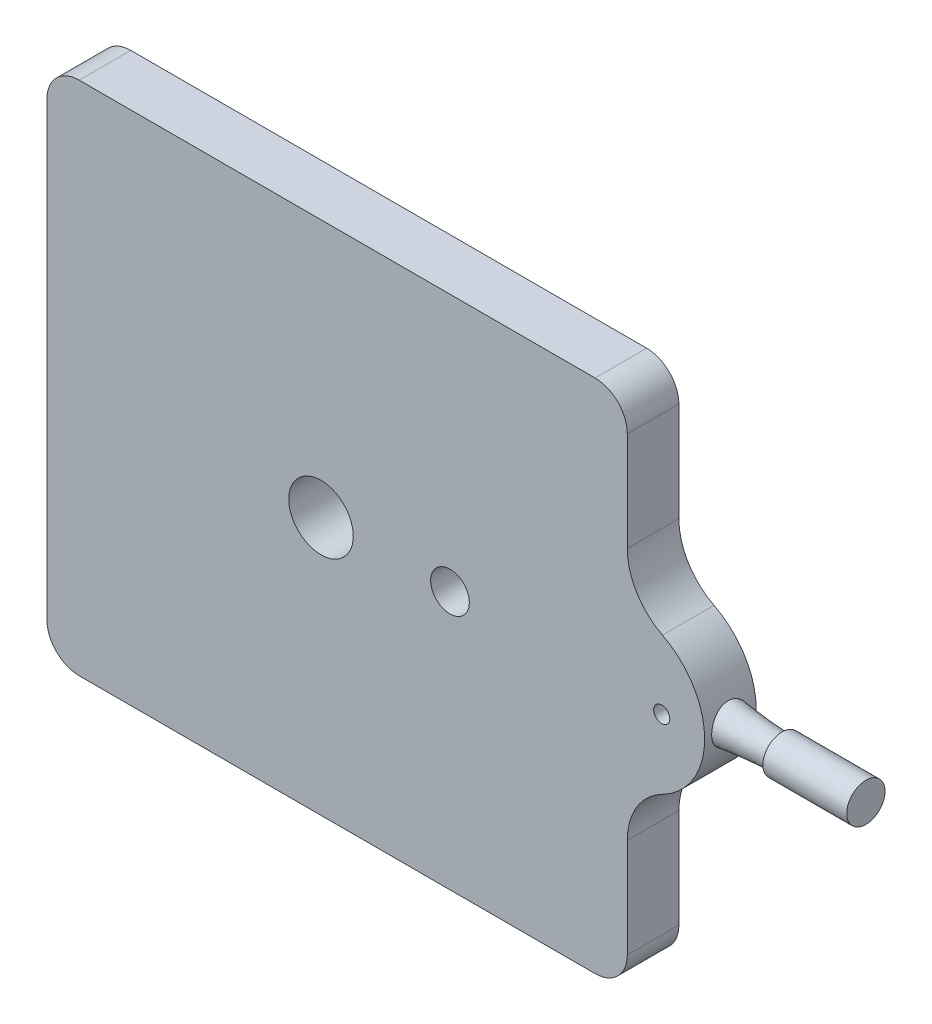
ISO-10303-21;
HEADER;
FILE_DESCRIPTION(('STEP AP214'),'2;1');
FILE_NAME('part.step','',(''),(''),'','','');
FILE_SCHEMA(('AUTOMOTIVE_DESIGN { 1 0 10303 214 1 1 1 1 }'));
ENDSEC;
DATA;
#1=APPLICATION_CONTEXT('core data for automotive mechanical design processes');
#2=APPLICATION_PROTOCOL_DEFINITION('international standard','automotive_design',2000,#1);
#3=PRODUCT_CONTEXT('',#1,'mechanical');
#4=PRODUCT('Part','Part','',(#3));
#5=PRODUCT_RELATED_PRODUCT_CATEGORY('part','',(#4));
#6=PRODUCT_DEFINITION_FORMATION('','',#4);
#7=PRODUCT_DEFINITION_CONTEXT('part definition',#1,'design');
#8=PRODUCT_DEFINITION('design','',#6,#7);
#9=PRODUCT_DEFINITION_SHAPE('','',#8);
#10=(LENGTH_UNIT() NAMED_UNIT(*) SI_UNIT(.MILLI.,.METRE.));
#11=(NAMED_UNIT(*) PLANE_ANGLE_UNIT() SI_UNIT($,.RADIAN.));
#12=(NAMED_UNIT(*) SI_UNIT($,.STERADIAN.) SOLID_ANGLE_UNIT());
#13=UNCERTAINTY_MEASURE_WITH_UNIT(LENGTH_MEASURE(1.E-05),#10,'distance_accuracy_value','');
#14=(GEOMETRIC_REPRESENTATION_CONTEXT(3) GLOBAL_UNCERTAINTY_ASSIGNED_CONTEXT((#13)) GLOBAL_UNIT_ASSIGNED_CONTEXT((#10,
#11,#12)) REPRESENTATION_CONTEXT('',''));
#15=CARTESIAN_POINT('',(0.,0.,0.));
#16=DIRECTION('',(0.,0.,1.));
#17=DIRECTION('',(1.,0.,0.));
#18=AXIS2_PLACEMENT_3D('',#15,#16,#17);
#19=CARTESIAN_POINT('',(98.,43.2575753217503,2.79937956443662));
#20=CARTESIAN_POINT('',(113.,40.4294832480824,1.70949875931951));
#21=CARTESIAN_POINT('',(98.,45.6588161928771,9.31453020793724));
#22=CARTESIAN_POINT('',(113.,45.0104857294434,2.56846525548432));
#23=CARTESIAN_POINT('',(98.,39.1436655493765,11.715771079064));
#24=CARTESIAN_POINT('',(113.,44.1515192332786,7.14946773684529));
#25=CARTESIAN_POINT('',(98.,36.7424246782497,5.20062043556338));
#26=CARTESIAN_POINT('',(113.,39.5705167519176,6.29050124068049));
#27=CARTESIAN_POINT('',(98.,34.3411838071229,-1.31453020793724));
#28=CARTESIAN_POINT('',(113.,34.9895142705566,5.43153474451568));
#29=CARTESIAN_POINT('',(98.,40.8563344506236,-3.715771079064));
#30=CARTESIAN_POINT('',(113.,35.8484807667214,0.850532263154708));
#31=CARTESIAN_POINT('',(98.,43.2575753217503,2.79937956443662));
#32=CARTESIAN_POINT('',(113.,40.4294832480824,1.70949875931951));
#33=(BOUNDED_SURFACE() B_SPLINE_SURFACE(3,1,((#19,#20),(#21,#22),(#23,#24),(#25,#26),(#27,#28),
(#29,#30),(#31,#32)),.UNSPECIFIED.,.T.,.F.,.F.) B_SPLINE_SURFACE_WITH_KNOTS((4,3,4),(2,2),(0.,
0.5,1.),(0.,1.),.UNSPECIFIED.) GEOMETRIC_REPRESENTATION_ITEM() RATIONAL_B_SPLINE_SURFACE(((1.,
1.),(0.333333333333333,0.333333333333333),(0.333333333333333,0.333333333333333),(1.,1.),
(0.333333333333333,0.333333333333334),(0.333333333333333,0.333333333333334),(1.,1.))) REPRESENTATION_ITEM('') SURFACE());
#34=CARTESIAN_POINT('',(101.724777274464,42.5553077826777,2.52874201411831));
#35=CARTESIAN_POINT('',(101.743278867291,42.470413085381,2.38601965428819));
#36=CARTESIAN_POINT('',(101.763479536152,42.3733149661882,2.25069037505992));
#37=CARTESIAN_POINT('',(101.804933986136,42.1576765359441,1.99840910106178));
#38=CARTESIAN_POINT('',(101.826188764263,42.0391156327924,1.88147495833069));
#39=CARTESIAN_POINT('',(101.867349026068,41.7840070472889,1.66913176549196));
#40=CARTESIAN_POINT('',(101.887255479603,41.6474725061007,1.57370712596093));
#41=CARTESIAN_POINT('',(101.923553392687,41.3600814604492,1.40682720232121));
#42=CARTESIAN_POINT('',(101.93994575508,41.2092286490576,1.33536575889065));
#43=CARTESIAN_POINT('',(101.967487603116,40.8966275818414,1.21815567622858));
#44=CARTESIAN_POINT('',(101.97861423915,40.7348352610521,1.17251893386084));
#45=CARTESIAN_POINT('',(101.994274977264,40.4055956315717,1.108858261088));
#46=CARTESIAN_POINT('',(101.998809624104,40.2381487913387,1.09083204895048));
#47=CARTESIAN_POINT('',(102.000760503256,39.9055251014301,1.08304086336107));
#48=CARTESIAN_POINT('',(101.998300953497,39.7403603449386,1.09278273210759));
#49=CARTESIAN_POINT('',(101.986799664501,39.4140934739424,1.13915885220264));
#50=CARTESIAN_POINT('',(101.977757978076,39.2529913268519,1.17579288777964));
#51=CARTESIAN_POINT('',(101.95410472116,38.9398153186393,1.2746920985953));
#52=CARTESIAN_POINT('',(101.939509097696,38.7877170362956,1.33688393020575));
#53=CARTESIAN_POINT('',(101.906295644316,38.4961098814801,1.48514098015115));
#54=CARTESIAN_POINT('',(101.887677283526,38.3566026740797,1.571209349859));
#55=CARTESIAN_POINT('',(101.848042136174,38.0915485493993,1.76666589645127));
#56=CARTESIAN_POINT('',(101.826989216805,37.9662871772077,1.87643421065043));
#57=CARTESIAN_POINT('',(101.78508318566,37.7360347444487,2.11555673903413));
#58=CARTESIAN_POINT('',(101.764230088,37.6310451062183,2.24491232639619));
#59=CARTESIAN_POINT('',(101.725059704888,37.4441944672495,2.52027580586157));
#60=CARTESIAN_POINT('',(101.706749516903,37.3623975626715,2.66632831072755));
#61=CARTESIAN_POINT('',(101.674963548063,37.2250712246865,2.97078907703068));
#62=CARTESIAN_POINT('',(101.661486475694,37.1695347726493,3.12919402383122));
#63=CARTESIAN_POINT('',(101.641436447889,37.0881848226555,3.44820563126083));
#64=CARTESIAN_POINT('',(101.634647018005,37.0614365832435,3.60856009953986));
#65=CARTESIAN_POINT('',(101.628049089351,37.0354312133784,3.9316107299046));
#66=CARTESIAN_POINT('',(101.628239004945,37.0361678386447,4.094306351708));
#67=CARTESIAN_POINT('',(101.63544625271,37.0645991701548,4.411651173468));
#68=CARTESIAN_POINT('',(101.642235196778,37.0913920998874,4.56638756914791));
#69=CARTESIAN_POINT('',(101.661505668315,37.1696479167619,4.86910768765103));
#70=CARTESIAN_POINT('',(101.673987557823,37.221112372881,5.01709098035737));
#71=CARTESIAN_POINT('',(101.703401102409,37.3477091743409,5.30401245873241));
#72=CARTESIAN_POINT('',(101.72037994877,37.4230943124394,5.44283396586129));
#73=CARTESIAN_POINT('',(101.756875720563,37.5950921394686,5.70626412603182));
#74=CARTESIAN_POINT('',(101.77639317553,37.6917092601362,5.83086980355202));
#75=CARTESIAN_POINT('',(101.816744672717,37.9078517811513,6.06765629135855));
#76=CARTESIAN_POINT('',(101.837600091319,38.0281425210962,6.17913541797508));
#77=CARTESIAN_POINT('',(101.877625723153,38.2856582759859,6.38082432903957));
#78=CARTESIAN_POINT('',(101.896795722319,38.4228854367304,6.4710314141532));
#79=CARTESIAN_POINT('',(101.931778651587,38.7137160096881,6.62948563035264));
#80=CARTESIAN_POINT('',(101.947512339685,38.8676035434771,6.69723002976938));
#81=CARTESIAN_POINT('',(101.973347195055,39.1849676069264,6.80610135551923));
#82=CARTESIAN_POINT('',(101.983448935824,39.3484431583711,6.84723099208431));
#83=CARTESIAN_POINT('',(101.996804063433,39.6781758572861,6.90125038343739));
#84=CARTESIAN_POINT('',(102.000141211688,39.844372967023,6.914485618559));
#85=CARTESIAN_POINT('',(101.999849575654,40.17665577995,6.91332154176844));
#86=CARTESIAN_POINT('',(101.996221302823,40.3427414904242,6.89892425886181));
#87=CARTESIAN_POINT('',(101.982489695288,40.6679130512955,6.84331670968964));
#88=CARTESIAN_POINT('',(101.972468316293,40.8270606436616,6.80244571979113));
#89=CARTESIAN_POINT('',(101.947099425229,41.1361711466054,6.69543967424967));
#90=CARTESIAN_POINT('',(101.931751444288,41.2861332472656,6.62930239449823));
#91=CARTESIAN_POINT('',(101.897149000844,41.5745496924652,6.47269053518026));
#92=CARTESIAN_POINT('',(101.877851198837,41.7128499900218,6.3819419672492));
#93=CARTESIAN_POINT('',(101.837538228137,41.9722964568685,6.17884210301937));
#94=CARTESIAN_POINT('',(101.816522821192,42.09344023996,6.06648780682089));
#95=CARTESIAN_POINT('',(101.774786020777,42.3167922142277,5.82130146219913));
#96=CARTESIAN_POINT('',(101.754072763127,42.4187140828686,5.68820670541898));
#97=CARTESIAN_POINT('',(101.715668293303,42.5983821623633,5.4061888421582));
#98=CARTESIAN_POINT('',(101.697976642708,42.676131881824,5.25726803705581));
#99=CARTESIAN_POINT('',(101.66809114554,42.8035466407041,4.95076259946163));
#100=CARTESIAN_POINT('',(101.655796668269,42.8537305526979,4.79340399276438));
#101=CARTESIAN_POINT('',(101.637757429058,42.9264370489996,4.47204907749634));
#102=CARTESIAN_POINT('',(101.632011406629,42.9489649567851,4.30805405264313));
#103=CARTESIAN_POINT('',(101.62789683565,42.9651427169174,3.98521940008389));
#104=CARTESIAN_POINT('',(101.62923999222,42.9599209994266,3.8264387199167));
#105=CARTESIAN_POINT('',(101.638476141498,42.9233931958955,3.51218116537641));
#106=CARTESIAN_POINT('',(101.646364852059,42.8921041632225,3.3567021991818));
#107=CARTESIAN_POINT('',(101.665402790703,42.8141738921144,3.0864633034101));
#108=CARTESIAN_POINT('',(101.675468999893,42.7723548293223,2.97020481015813));
#109=CARTESIAN_POINT('',(101.698305151748,42.6743581159785,2.7441929818499));
#110=CARTESIAN_POINT('',(101.711075270116,42.618179532279,2.63444007012759));
#111=CARTESIAN_POINT('',(101.724777274464,42.5553077826777,2.52874201411831));
#112=B_SPLINE_CURVE_WITH_KNOTS('',3,(#34,#35,#36,#37,#38,#39,#40,#41,#42,#43,#44,#45,#46,#47,
#48,#49,#50,#51,#52,#53,#54,#55,#56,#57,#58,#59,#60,#61,#62,#63,#64,#65,#66,#67,#68,#69,#70,#71,
#72,#73,#74,#75,#76,#77,#78,#79,#80,#81,#82,#83,#84,#85,#86,#87,#88,#89,#90,#91,#92,#93,#94,#95,
#96,#97,#98,#99,#100,#101,#102,#103,#104,#105,#106,#107,#108,#109,#110,#111),.UNSPECIFIED.,.T.,
.F.,(4,2,2,2,2,2,2,2,2,2,2,2,2,2,2,2,2,2,2,2,2,2,2,2,2,2,2,2,2,2,2,2,2,2,2,2,2,2,4),(0.,
0.500813150837702,1.00210936972109,1.50304108794034,2.00384395152402,2.50680046684185,
3.0097154156228,3.5037545980767,3.99778981660943,4.49041708600418,4.98310940634715,
5.48438501537861,5.98569578292095,6.48837877729375,6.99092734355454,7.47661447140754,
7.96219125677699,8.43153980148984,8.90091819822326,9.37543212561313,9.85004519220236,
10.3437553848249,10.8375281935619,11.3417045742336,11.8458296055822,12.3436732974174,
12.8414804348943,13.3330308268083,13.8246244982624,14.321933055841,14.8193107133534,
15.3235954887661,15.8278070326277,16.3221706377736,16.8164390684154,17.2907659813155,
17.7647828306343,18.1356534911253,18.5065482586336),.UNSPECIFIED.);
#113=CARTESIAN_POINT('',(101.724777274464,42.5553077826777,2.52874201411831));
#114=VERTEX_POINT('',#113);
#115=EDGE_CURVE('E193',#114,#114,#112,.T.);
#116=CARTESIAN_POINT('',(110.,40.,4.00000000000002));
#117=DIRECTION('',(1.,0.,0.));
#118=DIRECTION('',(0.,0.,-1.));
#119=AXIS2_PLACEMENT_3D('',#116,#117,#118);
#120=CIRCLE('',#119,2.29904056622465);
#121=CARTESIAN_POINT('',(110.,40.995101662816,1.92747492034293));
#122=VERTEX_POINT('',#121);
#123=EDGE_CURVE('E201',#122,#122,#120,.F.);
#124=CARTESIAN_POINT('',(101.724777274464,42.5553077826777,2.52874201411831));
#125=CARTESIAN_POINT('',(101.810977511188,42.5390556355958,2.52247881522481));
#126=CARTESIAN_POINT('',(101.897177747913,42.5228034885139,2.51621561633132));
#127=CARTESIAN_POINT('',(102.069578221361,42.4902991943501,2.50368921854433));
#128=CARTESIAN_POINT('',(102.155778458086,42.4740470472682,2.49742601965084));
#129=CARTESIAN_POINT('',(102.328178931534,42.4415427531044,2.48489962186385));
#130=CARTESIAN_POINT('',(102.414379168259,42.4252906060225,2.47863642297036));
#131=CARTESIAN_POINT('',(102.586779641707,42.3927863118587,2.46611002518337));
#132=CARTESIAN_POINT('',(102.672979878432,42.3765341647768,2.45984682628988));
#133=CARTESIAN_POINT('',(102.84538035188,42.3440298706131,2.44732042850289));
#134=CARTESIAN_POINT('',(102.931580588605,42.3277777235312,2.4410572296094));
#135=CARTESIAN_POINT('',(103.103981062053,42.2952734293674,2.42853083182241));
#136=CARTESIAN_POINT('',(103.190181298778,42.2790212822855,2.42226763292892));
#137=CARTESIAN_POINT('',(103.362581772226,42.2465169881217,2.40974123514193));
#138=CARTESIAN_POINT('',(103.448782008951,42.2302648410398,2.40347803624844));
#139=CARTESIAN_POINT('',(103.621182482399,42.197760546876,2.39095163846145));
#140=CARTESIAN_POINT('',(103.707382719124,42.1815083997941,2.38468843956796));
#141=CARTESIAN_POINT('',(103.879783192572,42.1490041056303,2.37216204178097));
#142=CARTESIAN_POINT('',(103.965983429297,42.1327519585485,2.36589884288748));
#143=CARTESIAN_POINT('',(104.138383902745,42.1002476643847,2.35337244510049));
#144=CARTESIAN_POINT('',(104.22458413947,42.0839955173028,2.347109246207));
#145=CARTESIAN_POINT('',(104.396984612918,42.051491223139,2.33458284842001));
#146=CARTESIAN_POINT('',(104.483184849643,42.0352390760571,2.32831964952651));
#147=CARTESIAN_POINT('',(104.655585323091,42.0027347818933,2.31579325173953));
#148=CARTESIAN_POINT('',(104.741785559816,41.9864826348114,2.30953005284604));
#149=CARTESIAN_POINT('',(104.914186033264,41.9539783406476,2.29700365505905));
#150=CARTESIAN_POINT('',(105.000386269989,41.9377261935658,2.29074045616555));
#151=CARTESIAN_POINT('',(105.172786743437,41.905221899402,2.27821405837857));
#152=CARTESIAN_POINT('',(105.258986980162,41.8889697523201,2.27195085948507));
#153=CARTESIAN_POINT('',(105.43138745361,41.8564654581563,2.25942446169809));
#154=CARTESIAN_POINT('',(105.517587690335,41.8402133110744,2.25316126280459));
#155=CARTESIAN_POINT('',(105.689988163783,41.8077090169106,2.24063486501761));
#156=CARTESIAN_POINT('',(105.776188400508,41.7914568698287,2.23437166612411));
#157=CARTESIAN_POINT('',(105.948588873956,41.7589525756649,2.22184526833713));
#158=CARTESIAN_POINT('',(106.034789110681,41.742700428583,2.21558206944363));
#159=CARTESIAN_POINT('',(106.207189584129,41.7101961344193,2.20305567165665));
#160=CARTESIAN_POINT('',(106.293389820854,41.6939439873374,2.19679247276315));
#161=CARTESIAN_POINT('',(106.465790294302,41.6614396931736,2.18426607497616));
#162=CARTESIAN_POINT('',(106.551990531027,41.6451875460917,2.17800287608267));
#163=CARTESIAN_POINT('',(106.724391004475,41.6126832519279,2.16547647829568));
#164=CARTESIAN_POINT('',(106.8105912412,41.596431104846,2.15921327940219));
#165=CARTESIAN_POINT('',(106.982991714648,41.5639268106822,2.1466868816152));
#166=CARTESIAN_POINT('',(107.069191951373,41.5476746636003,2.14042368272171));
#167=CARTESIAN_POINT('',(107.241592424821,41.5151703694365,2.12789728493472));
#168=CARTESIAN_POINT('',(107.327792661546,41.4989182223547,2.12163408604123));
#169=CARTESIAN_POINT('',(107.500193134994,41.4664139281909,2.10910768825424));
#170=CARTESIAN_POINT('',(107.586393371719,41.450161781109,2.10284448936075));
#171=CARTESIAN_POINT('',(107.758793845167,41.4176574869452,2.09031809157376));
#172=CARTESIAN_POINT('',(107.844994081892,41.4014053398633,2.08405489268027));
#173=CARTESIAN_POINT('',(108.01739455534,41.3689010456995,2.07152849489328));
#174=CARTESIAN_POINT('',(108.103594792065,41.3526488986176,2.06526529599979));
#175=CARTESIAN_POINT('',(108.275995265513,41.3201446044538,2.0527388982128));
#176=CARTESIAN_POINT('',(108.362195502238,41.3038924573719,2.04647569931931));
#177=CARTESIAN_POINT('',(108.534595975686,41.2713881632082,2.03394930153232));
#178=CARTESIAN_POINT('',(108.620796212411,41.2551360161263,2.02768610263883));
#179=CARTESIAN_POINT('',(108.793196685859,41.2226317219625,2.01515970485184));
#180=CARTESIAN_POINT('',(108.879396922584,41.2063795748806,2.00889650595835));
#181=CARTESIAN_POINT('',(109.051797396032,41.1738752807168,1.99637010817136));
#182=CARTESIAN_POINT('',(109.137997632757,41.1576231336349,1.99010690927787));
#183=CARTESIAN_POINT('',(109.310398106205,41.1251188394711,1.97758051149088));
#184=CARTESIAN_POINT('',(109.39659834293,41.1088666923892,1.97131731259739));
#185=CARTESIAN_POINT('',(109.568998816378,41.0763623982254,1.9587909148104));
#186=CARTESIAN_POINT('',(109.655199053103,41.0601102511436,1.95252771591691));
#187=CARTESIAN_POINT('',(109.827599526551,41.0276059569798,1.94000131812992));
#188=CARTESIAN_POINT('',(109.913799763276,41.0113538098979,1.93373811923643));
#189=CARTESIAN_POINT('',(110.,40.995101662816,1.92747492034293));
#190=B_SPLINE_CURVE_WITH_KNOTS('',3,(#124,#125,#126,#127,#128,#129,#130,#131,#132,#133,#134,
#135,#136,#137,#138,#139,#140,#141,#142,#143,#144,#145,#146,#147,#148,#149,#150,#151,#152,#153,
#154,#155,#156,#157,#158,#159,#160,#161,#162,#163,#164,#165,#166,#167,#168,#169,#170,#171,#172,
#173,#174,#175,#176,#177,#178,#179,#180,#181,#182,#183,#184,#185,#186,#187,#188,#189),
.UNSPECIFIED.,.F.,.F.,(4,2,2,2,2,2,2,2,2,2,2,2,2,2,2,2,2,2,2,2,2,2,2,2,2,2,2,2,2,2,2,2,4),(0.,
0.263826774244638,0.52765354848929,0.791480322733958,1.0553070969786,1.31913387122325,
1.5829606454679,1.84678741971257,2.11061419395721,2.37444096820186,2.63826774244651,
2.90209451669117,3.16592129093583,3.42974806518047,3.69357483942512,3.95740161366978,
4.22122838791443,4.48505516215908,4.74888193640374,5.01270871064839,5.27653548489306,
5.54036225913771,5.80418903338235,6.068015807627,6.33184258187165,6.59566935611631,
6.85949613036097,7.12332290460561,7.38714967885026,7.65097645309492,7.91480322733958,
8.17863000158422,8.44245677582888),.UNSPECIFIED.);
#191=EDGE_CURVE('BSEAM39',#114,#122,#190,.T.);
#192=ORIENTED_EDGE('',*,*,#115,.F.);
#193=ORIENTED_EDGE('',*,*,#123,.T.);
#194=ORIENTED_EDGE('',*,*,#191,.T.);
#195=ORIENTED_EDGE('',*,*,#191,.F.);
#196=EDGE_LOOP('',(#192,#194,#193,#195));
#197=FACE_BOUND('',#196,.T.);
#198=ADVANCED_FACE('F39',(#197),#33,.T.);
#199=CARTESIAN_POINT('',(100.,59.5959179422654,8.));
#200=DIRECTION('',(0.,0.,-1.));
#201=DIRECTION('',(-1.,0.,0.));
#202=AXIS2_PLACEMENT_3D('',#199,#200,#201);
#203=PLANE('',#202);
#204=CARTESIAN_POINT('',(62.5,40.0629594692849,8.));
#205=DIRECTION('',(0.,0.,1.));
#206=DIRECTION('',(1.,0.,0.));
#207=AXIS2_PLACEMENT_3D('',#204,#205,#206);
#208=CIRCLE('',#207,3.00000000000001);
#209=CARTESIAN_POINT('',(65.5,40.0629594692849,8.));
#210=VERTEX_POINT('',#209);
#211=EDGE_CURVE('E302',#210,#210,#208,.T.);
#212=ORIENTED_EDGE('',*,*,#211,.F.);
#213=EDGE_LOOP('',(#212));
#214=FACE_BOUND('',#213,.T.);
#215=CARTESIAN_POINT('',(95.34,40.,8.));
#216=DIRECTION('',(0.,0.,1.));
#217=DIRECTION('',(1.,0.,0.));
#218=AXIS2_PLACEMENT_3D('',#215,#216,#217);
#219=CIRCLE('',#218,1.25);
#220=CARTESIAN_POINT('',(96.59,40.,8.));
#221=VERTEX_POINT('',#220);
#222=EDGE_CURVE('E291',#221,#221,#219,.T.);
#223=ORIENTED_EDGE('',*,*,#222,.F.);
#224=EDGE_LOOP('',(#223));
#225=FACE_BOUND('',#224,.T.);
#226=DIRECTION('',(0.,1.,0.));
#227=VECTOR('',#226,1.);
#228=CARTESIAN_POINT('',(90.,59.5959179422654,8.));
#229=LINE('',#228,#227);
#230=CARTESIAN_POINT('',(90.,59.5959179422654,8.));
#231=VERTEX_POINT('',#230);
#232=CARTESIAN_POINT('',(90.,75.,8.));
#233=VERTEX_POINT('',#232);
#234=EDGE_CURVE('E161',#231,#233,#229,.T.);
#235=ORIENTED_EDGE('',*,*,#234,.T.);
#236=CARTESIAN_POINT('',(85.,75.,8.));
#237=DIRECTION('',(0.,0.,-1.));
#238=DIRECTION('',(-1.,0.,0.));
#239=AXIS2_PLACEMENT_3D('',#236,#237,#238);
#240=CIRCLE('',#239,5.);
#241=CARTESIAN_POINT('',(85.,80.,8.));
#242=VERTEX_POINT('',#241);
#243=EDGE_CURVE('E279',#233,#242,#240,.F.);
#244=ORIENTED_EDGE('',*,*,#243,.T.);
#245=DIRECTION('',(-1.,0.,0.));
#246=VECTOR('',#245,1.);
#247=CARTESIAN_POINT('',(0.,80.,8.));
#248=LINE('',#247,#246);
#249=CARTESIAN_POINT('',(4.99999999999999,80.,8.));
#250=VERTEX_POINT('',#249);
#251=EDGE_CURVE('E163',#242,#250,#248,.T.);
#252=ORIENTED_EDGE('',*,*,#251,.T.);
#253=CARTESIAN_POINT('',(4.99999999999999,75.,8.));
#254=DIRECTION('',(0.,0.,-1.));
#255=DIRECTION('',(-1.,0.,0.));
#256=AXIS2_PLACEMENT_3D('',#253,#254,#255);
#257=CIRCLE('',#256,5.);
#258=CARTESIAN_POINT('',(0.,75.,8.));
#259=VERTEX_POINT('',#258);
#260=EDGE_CURVE('E277',#250,#259,#257,.F.);
#261=ORIENTED_EDGE('',*,*,#260,.T.);
#262=DIRECTION('',(0.,-1.,0.));
#263=VECTOR('',#262,1.);
#264=CARTESIAN_POINT('',(0.,0.,8.));
#265=LINE('',#264,#263);
#266=CARTESIAN_POINT('',(0.,5.,8.));
#267=VERTEX_POINT('',#266);
#268=EDGE_CURVE('E186',#259,#267,#265,.T.);
#269=ORIENTED_EDGE('',*,*,#268,.T.);
#270=CARTESIAN_POINT('',(5.00000000000001,5.,8.));
#271=DIRECTION('',(0.,0.,-1.));
#272=DIRECTION('',(-1.,0.,0.));
#273=AXIS2_PLACEMENT_3D('',#270,#271,#272);
#274=CIRCLE('',#273,5.);
#275=CARTESIAN_POINT('',(5.,0.,8.));
#276=VERTEX_POINT('',#275);
#277=EDGE_CURVE('E275',#267,#276,#274,.F.);
#278=ORIENTED_EDGE('',*,*,#277,.T.);
#279=DIRECTION('',(1.,0.,0.));
#280=VECTOR('',#279,1.);
#281=CARTESIAN_POINT('',(0.,0.,8.));
#282=LINE('',#281,#280);
#283=CARTESIAN_POINT('',(85.,0.,8.));
#284=VERTEX_POINT('',#283);
#285=EDGE_CURVE('E139',#276,#284,#282,.T.);
#286=ORIENTED_EDGE('',*,*,#285,.T.);
#287=CARTESIAN_POINT('',(85.,5.,8.));
#288=DIRECTION('',(0.,0.,-1.));
#289=DIRECTION('',(-1.,0.,0.));
#290=AXIS2_PLACEMENT_3D('',#287,#288,#289);
#291=CIRCLE('',#290,5.);
#292=CARTESIAN_POINT('',(90.,5.,8.));
#293=VERTEX_POINT('',#292);
#294=EDGE_CURVE('E56',#284,#293,#291,.F.);
#295=ORIENTED_EDGE('',*,*,#294,.T.);
#296=DIRECTION('',(0.,1.,0.));
#297=VECTOR('',#296,1.);
#298=CARTESIAN_POINT('',(90.,0.,8.));
#299=LINE('',#298,#297);
#300=CARTESIAN_POINT('',(90.,20.4040820577346,8.));
#301=VERTEX_POINT('',#300);
#302=EDGE_CURVE('E129',#293,#301,#299,.T.);
#303=ORIENTED_EDGE('',*,*,#302,.T.);
#304=CARTESIAN_POINT('',(100.,20.4040820577346,8.));
#305=DIRECTION('',(0.,0.,-1.));
#306=DIRECTION('',(1.,0.,0.));
#307=AXIS2_PLACEMENT_3D('',#304,#305,#306);
#308=CIRCLE('',#307,10.);
#309=CARTESIAN_POINT('',(95.4545454545454,29.311317486037,8.));
#310=VERTEX_POINT('',#309);
#311=EDGE_CURVE('E135',#301,#310,#308,.T.);
#312=ORIENTED_EDGE('',*,*,#311,.T.);
#313=CARTESIAN_POINT('',(90.,40.,8.));
#314=DIRECTION('',(0.,0.,1.));
#315=DIRECTION('',(-1.,0.,0.));
#316=AXIS2_PLACEMENT_3D('',#313,#314,#315);
#317=CIRCLE('',#316,12.);
#318=CARTESIAN_POINT('',(95.4545454545454,50.688682513963,8.));
#319=VERTEX_POINT('',#318);
#320=EDGE_CURVE('E154',#310,#319,#317,.T.);
#321=ORIENTED_EDGE('',*,*,#320,.T.);
#322=CARTESIAN_POINT('',(100.,59.5959179422654,8.));
#323=DIRECTION('',(0.,0.,-1.));
#324=DIRECTION('',(-1.,0.,0.));
#325=AXIS2_PLACEMENT_3D('',#322,#323,#324);
#326=CIRCLE('',#325,10.);
#327=EDGE_CURVE('E156',#319,#231,#326,.T.);
#328=ORIENTED_EDGE('',*,*,#327,.T.);
#329=EDGE_LOOP('',(#235,#244,#252,#261,#269,#278,#286,#295,#303,#312,#321,#328));
#330=FACE_BOUND('',#329,.T.);
#331=CARTESIAN_POINT('',(42.5,40.,8.));
#332=DIRECTION('',(0.,0.,1.));
#333=DIRECTION('',(1.,0.,0.));
#334=AXIS2_PLACEMENT_3D('',#331,#332,#333);
#335=CIRCLE('',#334,5.);
#336=CARTESIAN_POINT('',(47.5,40.,8.));
#337=VERTEX_POINT('',#336);
#338=EDGE_CURVE('E169',#337,#337,#335,.T.);
#339=ORIENTED_EDGE('',*,*,#338,.F.);
#340=EDGE_LOOP('',(#339));
#341=FACE_BOUND('',#340,.T.);
#342=ADVANCED_FACE('F132',(#214,#225,#330,#341),#203,.F.);
#343=CARTESIAN_POINT('',(100.,59.5959179422654,0.));
#344=DIRECTION('',(0.,0.,-1.));
#345=DIRECTION('',(-1.,0.,0.));
#346=AXIS2_PLACEMENT_3D('',#343,#344,#345);
#347=PLANE('',#346);
#348=CARTESIAN_POINT('',(62.5,40.0629594692849,0.));
#349=DIRECTION('',(0.,0.,-1.));
#350=DIRECTION('',(-1.,0.,0.));
#351=AXIS2_PLACEMENT_3D('',#348,#349,#350);
#352=CIRCLE('',#351,3.00000000000001);
#353=CARTESIAN_POINT('',(59.5,40.0629594692849,0.));
#354=VERTEX_POINT('',#353);
#355=EDGE_CURVE('E43',#354,#354,#352,.T.);
#356=ORIENTED_EDGE('',*,*,#355,.F.);
#357=EDGE_LOOP('',(#356));
#358=FACE_BOUND('',#357,.T.);
#359=CARTESIAN_POINT('',(95.34,40.,0.));
#360=DIRECTION('',(0.,0.,-1.));
#361=DIRECTION('',(-1.,0.,0.));
#362=AXIS2_PLACEMENT_3D('',#359,#360,#361);
#363=CIRCLE('',#362,1.25);
#364=CARTESIAN_POINT('',(94.09,40.,0.));
#365=VERTEX_POINT('',#364);
#366=EDGE_CURVE('E288',#365,#365,#363,.T.);
#367=ORIENTED_EDGE('',*,*,#366,.F.);
#368=EDGE_LOOP('',(#367));
#369=FACE_BOUND('',#368,.T.);
#370=DIRECTION('',(-1.,0.,0.));
#371=VECTOR('',#370,1.);
#372=CARTESIAN_POINT('',(0.,80.,0.));
#373=LINE('',#372,#371);
#374=CARTESIAN_POINT('',(85.,80.,0.));
#375=VERTEX_POINT('',#374);
#376=CARTESIAN_POINT('',(4.99999999999999,80.,0.));
#377=VERTEX_POINT('',#376);
#378=EDGE_CURVE('E180',#375,#377,#373,.T.);
#379=ORIENTED_EDGE('',*,*,#378,.F.);
#380=CARTESIAN_POINT('',(85.,75.,0.));
#381=DIRECTION('',(0.,0.,-1.));
#382=DIRECTION('',(-1.,0.,0.));
#383=AXIS2_PLACEMENT_3D('',#380,#381,#382);
#384=CIRCLE('',#383,5.);
#385=CARTESIAN_POINT('',(90.,75.,0.));
#386=VERTEX_POINT('',#385);
#387=EDGE_CURVE('E262',#375,#386,#384,.T.);
#388=ORIENTED_EDGE('',*,*,#387,.T.);
#389=DIRECTION('',(0.,1.,0.));
#390=VECTOR('',#389,1.);
#391=CARTESIAN_POINT('',(90.,59.5959179422654,0.));
#392=LINE('',#391,#390);
#393=CARTESIAN_POINT('',(90.,59.5959179422654,0.));
#394=VERTEX_POINT('',#393);
#395=EDGE_CURVE('E177',#394,#386,#392,.T.);
#396=ORIENTED_EDGE('',*,*,#395,.F.);
#397=CARTESIAN_POINT('',(100.,59.5959179422654,0.));
#398=DIRECTION('',(0.,0.,-1.));
#399=DIRECTION('',(-1.,0.,0.));
#400=AXIS2_PLACEMENT_3D('',#397,#398,#399);
#401=CIRCLE('',#400,10.);
#402=CARTESIAN_POINT('',(95.4545454545454,50.688682513963,0.));
#403=VERTEX_POINT('',#402);
#404=EDGE_CURVE('E175',#403,#394,#401,.T.);
#405=ORIENTED_EDGE('',*,*,#404,.F.);
#406=CARTESIAN_POINT('',(90.,40.,0.));
#407=DIRECTION('',(0.,0.,1.));
#408=DIRECTION('',(-1.,0.,0.));
#409=AXIS2_PLACEMENT_3D('',#406,#407,#408);
#410=CIRCLE('',#409,12.);
#411=CARTESIAN_POINT('',(95.4545454545454,29.311317486037,0.));
#412=VERTEX_POINT('',#411);
#413=EDGE_CURVE('E173',#412,#403,#410,.T.);
#414=ORIENTED_EDGE('',*,*,#413,.F.);
#415=CARTESIAN_POINT('',(100.,20.4040820577346,0.));
#416=DIRECTION('',(0.,0.,-1.));
#417=DIRECTION('',(1.,0.,0.));
#418=AXIS2_PLACEMENT_3D('',#415,#416,#417);
#419=CIRCLE('',#418,10.);
#420=CARTESIAN_POINT('',(90.,20.4040820577346,0.));
#421=VERTEX_POINT('',#420);
#422=EDGE_CURVE('E171',#421,#412,#419,.T.);
#423=ORIENTED_EDGE('',*,*,#422,.F.);
#424=DIRECTION('',(0.,1.,0.));
#425=VECTOR('',#424,1.);
#426=CARTESIAN_POINT('',(90.,0.,0.));
#427=LINE('',#426,#425);
#428=CARTESIAN_POINT('',(90.,5.,0.));
#429=VERTEX_POINT('',#428);
#430=EDGE_CURVE('E145',#429,#421,#427,.T.);
#431=ORIENTED_EDGE('',*,*,#430,.F.);
#432=CARTESIAN_POINT('',(85.,5.,0.));
#433=DIRECTION('',(0.,0.,-1.));
#434=DIRECTION('',(-1.,0.,0.));
#435=AXIS2_PLACEMENT_3D('',#432,#433,#434);
#436=CIRCLE('',#435,5.);
#437=CARTESIAN_POINT('',(85.,0.,0.));
#438=VERTEX_POINT('',#437);
#439=EDGE_CURVE('E315',#429,#438,#436,.T.);
#440=ORIENTED_EDGE('',*,*,#439,.T.);
#441=DIRECTION('',(1.,0.,0.));
#442=VECTOR('',#441,1.);
#443=CARTESIAN_POINT('',(0.,0.,0.));
#444=LINE('',#443,#442);
#445=CARTESIAN_POINT('',(5.,0.,0.));
#446=VERTEX_POINT('',#445);
#447=EDGE_CURVE('E167',#446,#438,#444,.T.);
#448=ORIENTED_EDGE('',*,*,#447,.F.);
#449=CARTESIAN_POINT('',(5.00000000000001,5.,0.));
#450=DIRECTION('',(0.,0.,-1.));
#451=DIRECTION('',(-1.,0.,0.));
#452=AXIS2_PLACEMENT_3D('',#449,#450,#451);
#453=CIRCLE('',#452,5.);
#454=CARTESIAN_POINT('',(0.,5.,0.));
#455=VERTEX_POINT('',#454);
#456=EDGE_CURVE('E270',#446,#455,#453,.T.);
#457=ORIENTED_EDGE('',*,*,#456,.T.);
#458=DIRECTION('',(0.,-1.,0.));
#459=VECTOR('',#458,1.);
#460=CARTESIAN_POINT('',(0.,25.4040820577346,0.));
#461=LINE('',#460,#459);
#462=CARTESIAN_POINT('',(0.,75.,0.));
#463=VERTEX_POINT('',#462);
#464=EDGE_CURVE('E183',#463,#455,#461,.T.);
#465=ORIENTED_EDGE('',*,*,#464,.F.);
#466=CARTESIAN_POINT('',(4.99999999999999,75.,0.));
#467=DIRECTION('',(0.,0.,-1.));
#468=DIRECTION('',(-1.,0.,0.));
#469=AXIS2_PLACEMENT_3D('',#466,#467,#468);
#470=CIRCLE('',#469,5.);
#471=EDGE_CURVE('E267',#463,#377,#470,.T.);
#472=ORIENTED_EDGE('',*,*,#471,.T.);
#473=EDGE_LOOP('',(#379,#388,#396,#405,#414,#423,#431,#440,#448,#457,#465,#472));
#474=FACE_BOUND('',#473,.T.);
#475=CARTESIAN_POINT('',(42.5,40.,0.));
#476=DIRECTION('',(0.,0.,1.));
#477=DIRECTION('',(1.,0.,0.));
#478=AXIS2_PLACEMENT_3D('',#475,#476,#477);
#479=CIRCLE('',#478,5.);
#480=CARTESIAN_POINT('',(47.5,40.,0.));
#481=VERTEX_POINT('',#480);
#482=EDGE_CURVE('E200',#481,#481,#479,.T.);
#483=ORIENTED_EDGE('',*,*,#482,.T.);
#484=EDGE_LOOP('',(#483));
#485=FACE_BOUND('',#484,.T.);
#486=ADVANCED_FACE('F228',(#358,#369,#474,#485),#347,.T.);
#487=CARTESIAN_POINT('',(0.,0.,8.));
#488=DIRECTION('',(0.,1.,0.));
#489=DIRECTION('',(0.,0.,1.));
#490=AXIS2_PLACEMENT_3D('',#487,#488,#489);
#491=PLANE('',#490);
#492=ORIENTED_EDGE('',*,*,#285,.F.);
#493=DIRECTION('',(0.,0.,-1.));
#494=VECTOR('',#493,1.);
#495=CARTESIAN_POINT('',(5.00000000000001,0.,8.));
#496=LINE('',#495,#494);
#497=EDGE_CURVE('E48',#276,#446,#496,.T.);
#498=ORIENTED_EDGE('',*,*,#497,.T.);
#499=ORIENTED_EDGE('',*,*,#447,.T.);
#500=DIRECTION('',(0.,0.,-1.));
#501=VECTOR('',#500,1.);
#502=CARTESIAN_POINT('',(85.,0.,8.));
#503=LINE('',#502,#501);
#504=EDGE_CURVE('E64',#438,#284,#503,.F.);
#505=ORIENTED_EDGE('',*,*,#504,.T.);
#506=EDGE_LOOP('',(#492,#498,#499,#505));
#507=FACE_BOUND('',#506,.T.);
#508=ADVANCED_FACE('F232',(#507),#491,.F.);
#509=CARTESIAN_POINT('',(90.,0.,8.));
#510=DIRECTION('',(-1.,0.,0.));
#511=DIRECTION('',(0.,-1.,0.));
#512=AXIS2_PLACEMENT_3D('',#509,#510,#511);
#513=PLANE('',#512);
#514=ORIENTED_EDGE('',*,*,#302,.F.);
#515=DIRECTION('',(0.,0.,-1.));
#516=VECTOR('',#515,1.);
#517=CARTESIAN_POINT('',(90.,5.,8.));
#518=LINE('',#517,#516);
#519=EDGE_CURVE('E12',#293,#429,#518,.T.);
#520=ORIENTED_EDGE('',*,*,#519,.T.);
#521=ORIENTED_EDGE('',*,*,#430,.T.);
#522=DIRECTION('',(0.,0.,-1.));
#523=VECTOR('',#522,1.);
#524=CARTESIAN_POINT('',(90.,20.4040820577346,8.));
#525=LINE('',#524,#523);
#526=EDGE_CURVE('E142',#301,#421,#525,.T.);
#527=ORIENTED_EDGE('',*,*,#526,.F.);
#528=EDGE_LOOP('',(#514,#520,#521,#527));
#529=FACE_BOUND('',#528,.T.);
#530=ADVANCED_FACE('F143',(#529),#513,.F.);
#531=CARTESIAN_POINT('',(100.,20.4040820577346,8.));
#532=DIRECTION('',(0.,0.,-1.));
#533=DIRECTION('',(-1.,0.,0.));
#534=AXIS2_PLACEMENT_3D('',#531,#532,#533);
#535=CYLINDRICAL_SURFACE('',#534,10.);
#536=ORIENTED_EDGE('',*,*,#422,.T.);
#537=DIRECTION('',(0.,0.,-1.));
#538=VECTOR('',#537,1.);
#539=CARTESIAN_POINT('',(95.4545454545454,29.311317486037,8.));
#540=LINE('',#539,#538);
#541=EDGE_CURVE('E149',#310,#412,#540,.T.);
#542=ORIENTED_EDGE('',*,*,#541,.F.);
#543=ORIENTED_EDGE('',*,*,#311,.F.);
#544=ORIENTED_EDGE('',*,*,#526,.T.);
#545=EDGE_LOOP('',(#536,#542,#543,#544));
#546=FACE_BOUND('',#545,.T.);
#547=ADVANCED_FACE('F151',(#546),#535,.F.);
#548=CARTESIAN_POINT('',(90.,40.,8.));
#549=DIRECTION('',(0.,0.,-1.));
#550=DIRECTION('',(-1.,0.,0.));
#551=AXIS2_PLACEMENT_3D('',#548,#549,#550);
#552=CYLINDRICAL_SURFACE('',#551,12.);
#553=ORIENTED_EDGE('',*,*,#115,.T.);
#554=EDGE_LOOP('',(#553));
#555=FACE_BOUND('',#554,.T.);
#556=ORIENTED_EDGE('',*,*,#413,.T.);
#557=DIRECTION('',(0.,0.,-1.));
#558=VECTOR('',#557,1.);
#559=CARTESIAN_POINT('',(95.4545454545454,50.688682513963,8.));
#560=LINE('',#559,#558);
#561=EDGE_CURVE('E189',#319,#403,#560,.T.);
#562=ORIENTED_EDGE('',*,*,#561,.F.);
#563=ORIENTED_EDGE('',*,*,#320,.F.);
#564=ORIENTED_EDGE('',*,*,#541,.T.);
#565=EDGE_LOOP('',(#556,#562,#563,#564));
#566=FACE_BOUND('',#565,.T.);
#567=ADVANCED_FACE('F203',(#555,#566),#552,.T.);
#568=CARTESIAN_POINT('',(100.,59.5959179422654,8.));
#569=DIRECTION('',(0.,0.,-1.));
#570=DIRECTION('',(-1.,0.,0.));
#571=AXIS2_PLACEMENT_3D('',#568,#569,#570);
#572=CYLINDRICAL_SURFACE('',#571,10.);
#573=ORIENTED_EDGE('',*,*,#404,.T.);
#574=DIRECTION('',(0.,0.,-1.));
#575=VECTOR('',#574,1.);
#576=CARTESIAN_POINT('',(90.,59.5959179422654,8.));
#577=LINE('',#576,#575);
#578=EDGE_CURVE('E166',#231,#394,#577,.T.);
#579=ORIENTED_EDGE('',*,*,#578,.F.);
#580=ORIENTED_EDGE('',*,*,#327,.F.);
#581=ORIENTED_EDGE('',*,*,#561,.T.);
#582=EDGE_LOOP('',(#573,#579,#580,#581));
#583=FACE_BOUND('',#582,.T.);
#584=ADVANCED_FACE('F243',(#583),#572,.F.);
#585=CARTESIAN_POINT('',(90.,59.5959179422654,8.));
#586=DIRECTION('',(-1.,0.,0.));
#587=DIRECTION('',(0.,-1.,0.));
#588=AXIS2_PLACEMENT_3D('',#585,#586,#587);
#589=PLANE('',#588);
#590=ORIENTED_EDGE('',*,*,#395,.T.);
#591=DIRECTION('',(0.,0.,-1.));
#592=VECTOR('',#591,1.);
#593=CARTESIAN_POINT('',(90.,75.,8.));
#594=LINE('',#593,#592);
#595=EDGE_CURVE('E266',#386,#233,#594,.F.);
#596=ORIENTED_EDGE('',*,*,#595,.T.);
#597=ORIENTED_EDGE('',*,*,#234,.F.);
#598=ORIENTED_EDGE('',*,*,#578,.T.);
#599=EDGE_LOOP('',(#590,#596,#597,#598));
#600=FACE_BOUND('',#599,.T.);
#601=ADVANCED_FACE('F240',(#600),#589,.F.);
#602=CARTESIAN_POINT('',(0.,80.,8.));
#603=DIRECTION('',(0.,-1.,0.));
#604=DIRECTION('',(0.,0.,-1.));
#605=AXIS2_PLACEMENT_3D('',#602,#603,#604);
#606=PLANE('',#605);
#607=ORIENTED_EDGE('',*,*,#251,.F.);
#608=DIRECTION('',(0.,0.,-1.));
#609=VECTOR('',#608,1.);
#610=CARTESIAN_POINT('',(85.,80.,8.));
#611=LINE('',#610,#609);
#612=EDGE_CURVE('E321',#242,#375,#611,.T.);
#613=ORIENTED_EDGE('',*,*,#612,.T.);
#614=ORIENTED_EDGE('',*,*,#378,.T.);
#615=DIRECTION('',(0.,0.,-1.));
#616=VECTOR('',#615,1.);
#617=CARTESIAN_POINT('',(4.99999999999999,80.,8.));
#618=LINE('',#617,#616);
#619=EDGE_CURVE('E148',#377,#250,#618,.F.);
#620=ORIENTED_EDGE('',*,*,#619,.T.);
#621=EDGE_LOOP('',(#607,#613,#614,#620));
#622=FACE_BOUND('',#621,.T.);
#623=ADVANCED_FACE('F236',(#622),#606,.F.);
#624=CARTESIAN_POINT('',(0.,25.4040820577346,8.));
#625=DIRECTION('',(1.,0.,0.));
#626=DIRECTION('',(0.,1.,0.));
#627=AXIS2_PLACEMENT_3D('',#624,#625,#626);
#628=PLANE('',#627);
#629=ORIENTED_EDGE('',*,*,#268,.F.);
#630=DIRECTION('',(0.,0.,-1.));
#631=VECTOR('',#630,1.);
#632=CARTESIAN_POINT('',(0.,75.,8.));
#633=LINE('',#632,#631);
#634=EDGE_CURVE('E283',#259,#463,#633,.T.);
#635=ORIENTED_EDGE('',*,*,#634,.T.);
#636=ORIENTED_EDGE('',*,*,#464,.T.);
#637=DIRECTION('',(0.,0.,-1.));
#638=VECTOR('',#637,1.);
#639=CARTESIAN_POINT('',(0.,5.,8.));
#640=LINE('',#639,#638);
#641=EDGE_CURVE('E281',#455,#267,#640,.F.);
#642=ORIENTED_EDGE('',*,*,#641,.T.);
#643=EDGE_LOOP('',(#629,#635,#636,#642));
#644=FACE_BOUND('',#643,.T.);
#645=ADVANCED_FACE('F224',(#644),#628,.F.);
#646=CARTESIAN_POINT('',(42.5,40.,8.));
#647=DIRECTION('',(0.,0.,-1.));
#648=DIRECTION('',(-1.,0.,0.));
#649=AXIS2_PLACEMENT_3D('',#646,#647,#648);
#650=CYLINDRICAL_SURFACE('',#649,5.);
#651=ORIENTED_EDGE('',*,*,#338,.T.);
#652=EDGE_LOOP('',(#651));
#653=FACE_BOUND('',#652,.T.);
#654=ORIENTED_EDGE('',*,*,#482,.F.);
#655=EDGE_LOOP('',(#654));
#656=FACE_BOUND('',#655,.T.);
#657=ADVANCED_FACE('F216',(#653,#656),#650,.F.);
#658=CARTESIAN_POINT('',(110.,40.,4.));
#659=DIRECTION('',(1.,0.,0.));
#660=DIRECTION('',(0.,0.,-1.));
#661=AXIS2_PLACEMENT_3D('',#658,#659,#660);
#662=CYLINDRICAL_SURFACE('',#661,2.97003332902293);
#663=CARTESIAN_POINT('',(110.,40.,4.));
#664=DIRECTION('',(1.,0.,0.));
#665=DIRECTION('',(0.,0.,-1.));
#666=AXIS2_PLACEMENT_3D('',#663,#664,#665);
#667=CIRCLE('',#666,2.97003332902293);
#668=CARTESIAN_POINT('',(110.,40.,1.02996667097707));
#669=VERTEX_POINT('',#668);
#670=EDGE_CURVE('E295',#669,#669,#667,.T.);
#671=ORIENTED_EDGE('',*,*,#670,.T.);
#672=EDGE_LOOP('',(#671));
#673=FACE_BOUND('',#672,.T.);
#674=CARTESIAN_POINT('',(123.,40.,4.));
#675=DIRECTION('',(1.,0.,0.));
#676=DIRECTION('',(0.,0.,-1.));
#677=AXIS2_PLACEMENT_3D('',#674,#675,#676);
#678=CIRCLE('',#677,2.97003332902293);
#679=CARTESIAN_POINT('',(123.,40.,1.02996667097707));
#680=VERTEX_POINT('',#679);
#681=EDGE_CURVE('E290',#680,#680,#678,.T.);
#682=ORIENTED_EDGE('',*,*,#681,.F.);
#683=EDGE_LOOP('',(#682));
#684=FACE_BOUND('',#683,.T.);
#685=ADVANCED_FACE('F214',(#673,#684),#662,.T.);
#686=CARTESIAN_POINT('',(110.,40.,4.));
#687=DIRECTION('',(1.,0.,0.));
#688=DIRECTION('',(0.,0.,-1.));
#689=AXIS2_PLACEMENT_3D('',#686,#687,#688);
#690=PLANE('',#689);
#691=ORIENTED_EDGE('',*,*,#123,.F.);
#692=EDGE_LOOP('',(#691));
#693=FACE_BOUND('',#692,.T.);
#694=ORIENTED_EDGE('',*,*,#670,.F.);
#695=EDGE_LOOP('',(#694));
#696=FACE_BOUND('',#695,.T.);
#697=ADVANCED_FACE('F360',(#693,#696),#690,.F.);
#698=CARTESIAN_POINT('',(123.,40.,4.));
#699=DIRECTION('',(1.,0.,0.));
#700=DIRECTION('',(0.,0.,-1.));
#701=AXIS2_PLACEMENT_3D('',#698,#699,#700);
#702=PLANE('',#701);
#703=ORIENTED_EDGE('',*,*,#681,.T.);
#704=EDGE_LOOP('',(#703));
#705=FACE_BOUND('',#704,.T.);
#706=ADVANCED_FACE('F340',(#705),#702,.T.);
#707=CARTESIAN_POINT('',(85.,75.,8.));
#708=DIRECTION('',(0.,0.,-1.));
#709=DIRECTION('',(-1.,0.,0.));
#710=AXIS2_PLACEMENT_3D('',#707,#708,#709);
#711=CYLINDRICAL_SURFACE('',#710,5.);
#712=ORIENTED_EDGE('',*,*,#243,.F.);
#713=ORIENTED_EDGE('',*,*,#595,.F.);
#714=ORIENTED_EDGE('',*,*,#387,.F.);
#715=ORIENTED_EDGE('',*,*,#612,.F.);
#716=EDGE_LOOP('',(#712,#713,#714,#715));
#717=FACE_BOUND('',#716,.T.);
#718=ADVANCED_FACE('F320',(#717),#711,.T.);
#719=CARTESIAN_POINT('',(4.99999999999999,75.,8.));
#720=DIRECTION('',(0.,0.,-1.));
#721=DIRECTION('',(-1.,0.,0.));
#722=AXIS2_PLACEMENT_3D('',#719,#720,#721);
#723=CYLINDRICAL_SURFACE('',#722,5.);
#724=ORIENTED_EDGE('',*,*,#260,.F.);
#725=ORIENTED_EDGE('',*,*,#619,.F.);
#726=ORIENTED_EDGE('',*,*,#471,.F.);
#727=ORIENTED_EDGE('',*,*,#634,.F.);
#728=EDGE_LOOP('',(#724,#725,#726,#727));
#729=FACE_BOUND('',#728,.T.);
#730=ADVANCED_FACE('F339',(#729),#723,.T.);
#731=CARTESIAN_POINT('',(5.00000000000001,5.,8.));
#732=DIRECTION('',(0.,0.,-1.));
#733=DIRECTION('',(-1.,0.,0.));
#734=AXIS2_PLACEMENT_3D('',#731,#732,#733);
#735=CYLINDRICAL_SURFACE('',#734,5.);
#736=ORIENTED_EDGE('',*,*,#277,.F.);
#737=ORIENTED_EDGE('',*,*,#641,.F.);
#738=ORIENTED_EDGE('',*,*,#456,.F.);
#739=ORIENTED_EDGE('',*,*,#497,.F.);
#740=EDGE_LOOP('',(#736,#737,#738,#739));
#741=FACE_BOUND('',#740,.T.);
#742=ADVANCED_FACE('F329',(#741),#735,.T.);
#743=CARTESIAN_POINT('',(85.,5.,8.));
#744=DIRECTION('',(0.,0.,-1.));
#745=DIRECTION('',(-1.,0.,0.));
#746=AXIS2_PLACEMENT_3D('',#743,#744,#745);
#747=CYLINDRICAL_SURFACE('',#746,5.);
#748=ORIENTED_EDGE('',*,*,#294,.F.);
#749=ORIENTED_EDGE('',*,*,#504,.F.);
#750=ORIENTED_EDGE('',*,*,#439,.F.);
#751=ORIENTED_EDGE('',*,*,#519,.F.);
#752=EDGE_LOOP('',(#748,#749,#750,#751));
#753=FACE_BOUND('',#752,.T.);
#754=ADVANCED_FACE('F41',(#753),#747,.T.);
#755=CARTESIAN_POINT('',(95.34,40.,-2.));
#756=DIRECTION('',(0.,0.,1.));
#757=DIRECTION('',(1.,0.,0.));
#758=AXIS2_PLACEMENT_3D('',#755,#756,#757);
#759=CYLINDRICAL_SURFACE('',#758,1.25);
#760=ORIENTED_EDGE('',*,*,#366,.T.);
#761=EDGE_LOOP('',(#760));
#762=FACE_BOUND('',#761,.T.);
#763=ORIENTED_EDGE('',*,*,#222,.T.);
#764=EDGE_LOOP('',(#763));
#765=FACE_BOUND('',#764,.T.);
#766=ADVANCED_FACE('F347',(#762,#765),#759,.F.);
#767=CARTESIAN_POINT('',(62.5,40.0629594692849,-2.));
#768=DIRECTION('',(0.,0.,1.));
#769=DIRECTION('',(1.,0.,0.));
#770=AXIS2_PLACEMENT_3D('',#767,#768,#769);
#771=CYLINDRICAL_SURFACE('',#770,3.00000000000001);
#772=ORIENTED_EDGE('',*,*,#355,.T.);
#773=EDGE_LOOP('',(#772));
#774=FACE_BOUND('',#773,.T.);
#775=ORIENTED_EDGE('',*,*,#211,.T.);
#776=EDGE_LOOP('',(#775));
#777=FACE_BOUND('',#776,.T.);
#778=ADVANCED_FACE('F351',(#774,#777),#771,.F.);
#779=CLOSED_SHELL('',(#198,#342,#486,#508,#530,#547,#567,#584,#601,#623,#645,#657,#685,#697,
#706,#718,#730,#742,#754,#766,#778));
#780=MANIFOLD_SOLID_BREP('B2',#779);
#781=ADVANCED_BREP_SHAPE_REPRESENTATION('',(#18,#780),#14);
#782=SHAPE_DEFINITION_REPRESENTATION(#9,#781);
ENDSEC;
END-ISO-10303-21;
